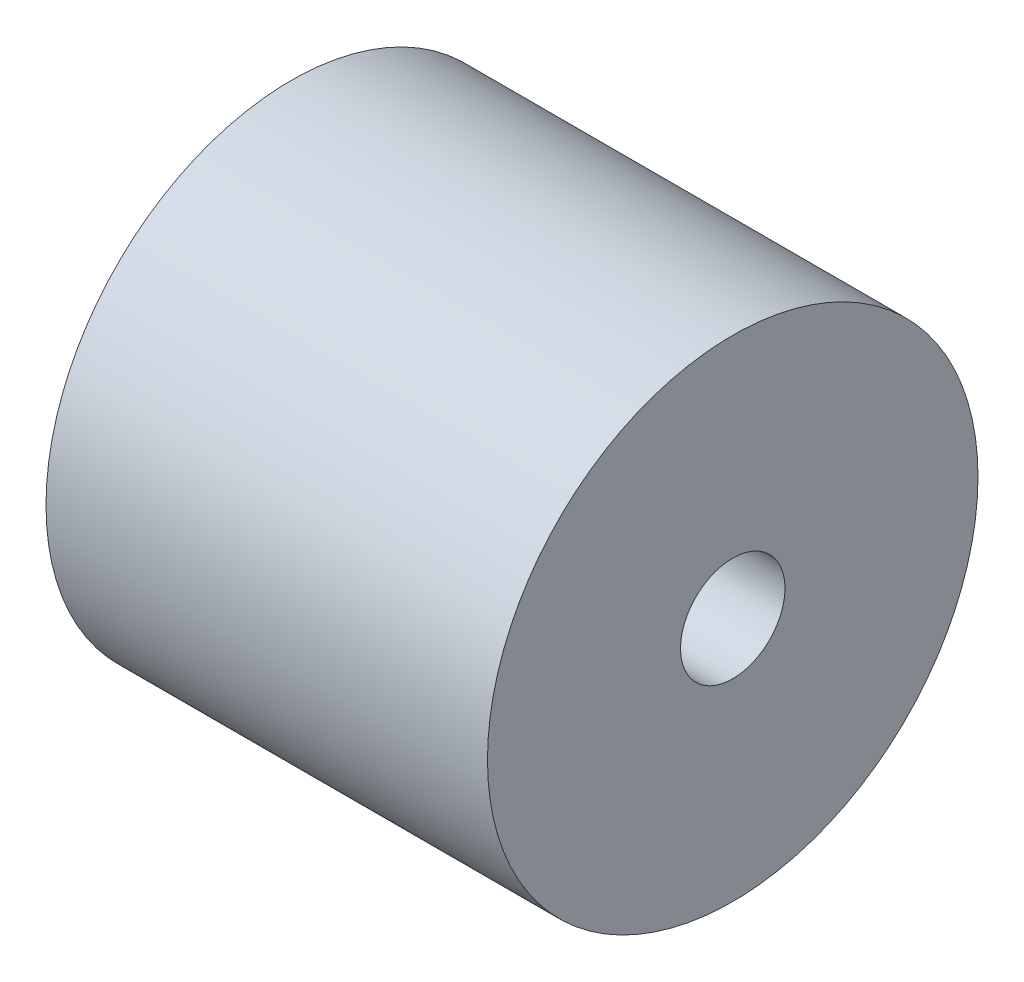
ISO-10303-21;
HEADER;
FILE_DESCRIPTION(('STEP AP214'),'2;1');
FILE_NAME('part.step','',(''),(''),'','','');
FILE_SCHEMA(('AUTOMOTIVE_DESIGN { 1 0 10303 214 1 1 1 1 }'));
ENDSEC;
DATA;
#1=APPLICATION_CONTEXT('core data for automotive mechanical design processes');
#2=APPLICATION_PROTOCOL_DEFINITION('international standard','automotive_design',2000,#1);
#3=PRODUCT_CONTEXT('',#1,'mechanical');
#4=PRODUCT('Part','Part','',(#3));
#5=PRODUCT_RELATED_PRODUCT_CATEGORY('part','',(#4));
#6=PRODUCT_DEFINITION_FORMATION('','',#4);
#7=PRODUCT_DEFINITION_CONTEXT('part definition',#1,'design');
#8=PRODUCT_DEFINITION('design','',#6,#7);
#9=PRODUCT_DEFINITION_SHAPE('','',#8);
#10=(LENGTH_UNIT() NAMED_UNIT(*) SI_UNIT(.MILLI.,.METRE.));
#11=(NAMED_UNIT(*) PLANE_ANGLE_UNIT() SI_UNIT($,.RADIAN.));
#12=(NAMED_UNIT(*) SI_UNIT($,.STERADIAN.) SOLID_ANGLE_UNIT());
#13=UNCERTAINTY_MEASURE_WITH_UNIT(LENGTH_MEASURE(1.E-05),#10,'distance_accuracy_value','');
#14=(GEOMETRIC_REPRESENTATION_CONTEXT(3) GLOBAL_UNCERTAINTY_ASSIGNED_CONTEXT((#13)) GLOBAL_UNIT_ASSIGNED_CONTEXT((#10,
#11,#12)) REPRESENTATION_CONTEXT('',''));
#15=CARTESIAN_POINT('',(0.,0.,0.));
#16=DIRECTION('',(0.,0.,1.));
#17=DIRECTION('',(1.,0.,0.));
#18=AXIS2_PLACEMENT_3D('',#15,#16,#17);
#19=CARTESIAN_POINT('',(11.43,0.,0.));
#20=DIRECTION('',(-1.,0.,0.));
#21=DIRECTION('',(0.,0.,1.));
#22=AXIS2_PLACEMENT_3D('',#19,#20,#21);
#23=CYLINDRICAL_SURFACE('',#22,6.35);
#24=CARTESIAN_POINT('',(11.43,0.,0.));
#25=DIRECTION('',(1.,0.,0.));
#26=DIRECTION('',(0.,0.,-1.));
#27=AXIS2_PLACEMENT_3D('',#24,#25,#26);
#28=CIRCLE('',#27,6.35);
#29=CARTESIAN_POINT('',(11.43,0.,-6.35));
#30=VERTEX_POINT('',#29);
#31=EDGE_CURVE('E10',#30,#30,#28,.T.);
#32=ORIENTED_EDGE('',*,*,#31,.F.);
#33=EDGE_LOOP('',(#32));
#34=FACE_BOUND('',#33,.T.);
#35=CARTESIAN_POINT('',(0.,0.,0.));
#36=DIRECTION('',(1.,0.,0.));
#37=DIRECTION('',(0.,0.,-1.));
#38=AXIS2_PLACEMENT_3D('',#35,#36,#37);
#39=CIRCLE('',#38,6.35);
#40=CARTESIAN_POINT('',(0.,0.,-6.35));
#41=VERTEX_POINT('',#40);
#42=EDGE_CURVE('E36',#41,#41,#39,.T.);
#43=ORIENTED_EDGE('',*,*,#42,.T.);
#44=EDGE_LOOP('',(#43));
#45=FACE_BOUND('',#44,.T.);
#46=ADVANCED_FACE('F33',(#34,#45),#23,.T.);
#47=CARTESIAN_POINT('',(11.43,0.,0.));
#48=DIRECTION('',(1.,0.,0.));
#49=DIRECTION('',(0.,0.,-1.));
#50=AXIS2_PLACEMENT_3D('',#47,#48,#49);
#51=PLANE('',#50);
#52=CARTESIAN_POINT('',(11.43,0.,0.));
#53=DIRECTION('',(-1.,0.,0.));
#54=DIRECTION('',(0.,0.,1.));
#55=AXIS2_PLACEMENT_3D('',#52,#53,#54);
#56=CIRCLE('',#55,1.35255);
#57=CARTESIAN_POINT('',(11.43,0.,1.35255));
#58=VERTEX_POINT('',#57);
#59=EDGE_CURVE('E43',#58,#58,#56,.T.);
#60=ORIENTED_EDGE('',*,*,#59,.T.);
#61=EDGE_LOOP('',(#60));
#62=FACE_BOUND('',#61,.T.);
#63=ORIENTED_EDGE('',*,*,#31,.T.);
#64=EDGE_LOOP('',(#63));
#65=FACE_BOUND('',#64,.T.);
#66=ADVANCED_FACE('F56',(#62,#65),#51,.T.);
#67=CARTESIAN_POINT('',(0.,0.,0.));
#68=DIRECTION('',(1.,0.,0.));
#69=DIRECTION('',(0.,0.,-1.));
#70=AXIS2_PLACEMENT_3D('',#67,#68,#69);
#71=PLANE('',#70);
#72=CARTESIAN_POINT('',(0.,0.,0.));
#73=DIRECTION('',(-1.,0.,0.));
#74=DIRECTION('',(0.,0.,1.));
#75=AXIS2_PLACEMENT_3D('',#72,#73,#74);
#76=CIRCLE('',#75,1.35254999999999);
#77=CARTESIAN_POINT('',(0.,0.,1.35254999999999));
#78=VERTEX_POINT('',#77);
#79=EDGE_CURVE('E47',#78,#78,#76,.T.);
#80=ORIENTED_EDGE('',*,*,#79,.F.);
#81=EDGE_LOOP('',(#80));
#82=FACE_BOUND('',#81,.T.);
#83=ORIENTED_EDGE('',*,*,#42,.F.);
#84=EDGE_LOOP('',(#83));
#85=FACE_BOUND('',#84,.T.);
#86=ADVANCED_FACE('F53',(#82,#85),#71,.F.);
#87=CARTESIAN_POINT('',(0.,0.,0.));
#88=DIRECTION('',(-1.,0.,0.));
#89=DIRECTION('',(0.,0.,1.));
#90=AXIS2_PLACEMENT_3D('',#87,#88,#89);
#91=CYLINDRICAL_SURFACE('',#90,1.35254999999999);
#92=ORIENTED_EDGE('',*,*,#59,.F.);
#93=EDGE_LOOP('',(#92));
#94=FACE_BOUND('',#93,.T.);
#95=ORIENTED_EDGE('',*,*,#79,.T.);
#96=EDGE_LOOP('',(#95));
#97=FACE_BOUND('',#96,.T.);
#98=ADVANCED_FACE('F51',(#94,#97),#91,.F.);
#99=CLOSED_SHELL('',(#46,#66,#86,#98));
#100=MANIFOLD_SOLID_BREP('B2',#99);
#101=ADVANCED_BREP_SHAPE_REPRESENTATION('',(#18,#100),#14);
#102=SHAPE_DEFINITION_REPRESENTATION(#9,#101);
ENDSEC;
END-ISO-10303-21;
